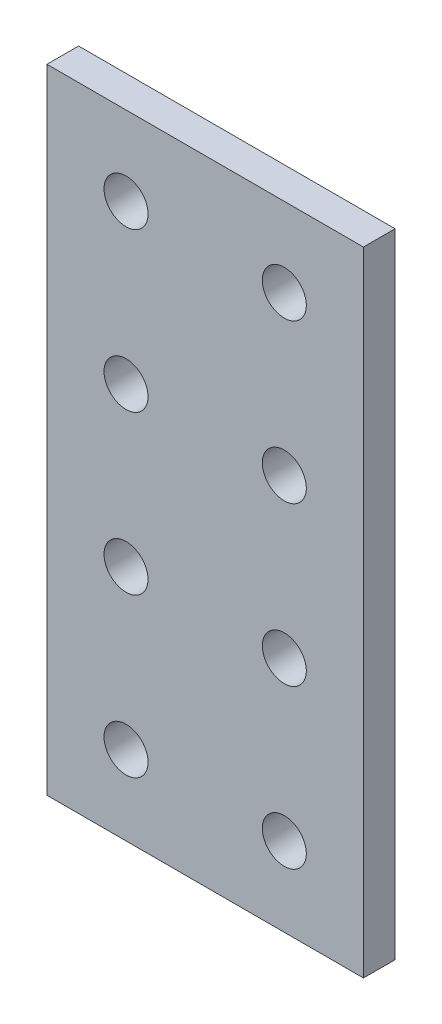
ISO-10303-21;
HEADER;
FILE_DESCRIPTION(('STEP AP214'),'2;1');
FILE_NAME('part.step','',(''),(''),'','','');
FILE_SCHEMA(('AUTOMOTIVE_DESIGN { 1 0 10303 214 1 1 1 1 }'));
ENDSEC;
DATA;
#1=APPLICATION_CONTEXT('core data for automotive mechanical design processes');
#2=APPLICATION_PROTOCOL_DEFINITION('international standard','automotive_design',2000,#1);
#3=PRODUCT_CONTEXT('',#1,'mechanical');
#4=PRODUCT('Part','Part','',(#3));
#5=PRODUCT_RELATED_PRODUCT_CATEGORY('part','',(#4));
#6=PRODUCT_DEFINITION_FORMATION('','',#4);
#7=PRODUCT_DEFINITION_CONTEXT('part definition',#1,'design');
#8=PRODUCT_DEFINITION('design','',#6,#7);
#9=PRODUCT_DEFINITION_SHAPE('','',#8);
#10=(LENGTH_UNIT() NAMED_UNIT(*) SI_UNIT(.MILLI.,.METRE.));
#11=(NAMED_UNIT(*) PLANE_ANGLE_UNIT() SI_UNIT($,.RADIAN.));
#12=(NAMED_UNIT(*) SI_UNIT($,.STERADIAN.) SOLID_ANGLE_UNIT());
#13=UNCERTAINTY_MEASURE_WITH_UNIT(LENGTH_MEASURE(1.E-05),#10,'distance_accuracy_value','');
#14=(GEOMETRIC_REPRESENTATION_CONTEXT(3) GLOBAL_UNCERTAINTY_ASSIGNED_CONTEXT((#13)) GLOBAL_UNIT_ASSIGNED_CONTEXT((#10,
#11,#12)) REPRESENTATION_CONTEXT('',''));
#15=CARTESIAN_POINT('',(0.,0.,0.));
#16=DIRECTION('',(0.,0.,1.));
#17=DIRECTION('',(1.,0.,0.));
#18=AXIS2_PLACEMENT_3D('',#15,#16,#17);
#19=CARTESIAN_POINT('',(20.,0.,0.));
#20=DIRECTION('',(1.,0.,0.));
#21=DIRECTION('',(0.,0.,-1.));
#22=AXIS2_PLACEMENT_3D('',#19,#20,#21);
#23=PLANE('',#22);
#24=DIRECTION('',(0.,1.,0.));
#25=VECTOR('',#24,1.);
#26=CARTESIAN_POINT('',(20.,0.,4.));
#27=LINE('',#26,#25);
#28=CARTESIAN_POINT('',(20.,0.,4.));
#29=VERTEX_POINT('',#28);
#30=CARTESIAN_POINT('',(20.,80.,4.));
#31=VERTEX_POINT('',#30);
#32=EDGE_CURVE('E102',#29,#31,#27,.T.);
#33=ORIENTED_EDGE('',*,*,#32,.F.);
#34=DIRECTION('',(0.,0.,1.));
#35=VECTOR('',#34,1.);
#36=CARTESIAN_POINT('',(20.,0.,0.));
#37=LINE('',#36,#35);
#38=CARTESIAN_POINT('',(20.,0.,0.));
#39=VERTEX_POINT('',#38);
#40=EDGE_CURVE('E11',#39,#29,#37,.T.);
#41=ORIENTED_EDGE('',*,*,#40,.F.);
#42=DIRECTION('',(0.,1.,0.));
#43=VECTOR('',#42,1.);
#44=CARTESIAN_POINT('',(20.,0.,0.));
#45=LINE('',#44,#43);
#46=CARTESIAN_POINT('',(20.,80.,0.));
#47=VERTEX_POINT('',#46);
#48=EDGE_CURVE('E95',#39,#47,#45,.T.);
#49=ORIENTED_EDGE('',*,*,#48,.T.);
#50=DIRECTION('',(0.,0.,1.));
#51=VECTOR('',#50,1.);
#52=CARTESIAN_POINT('',(20.,80.,0.));
#53=LINE('',#52,#51);
#54=EDGE_CURVE('E40',#47,#31,#53,.T.);
#55=ORIENTED_EDGE('',*,*,#54,.T.);
#56=EDGE_LOOP('',(#33,#41,#49,#55));
#57=FACE_BOUND('',#56,.T.);
#58=ADVANCED_FACE('F37',(#57),#23,.T.);
#59=CARTESIAN_POINT('',(-20.,0.,0.));
#60=DIRECTION('',(0.,-1.,0.));
#61=DIRECTION('',(0.,0.,-1.));
#62=AXIS2_PLACEMENT_3D('',#59,#60,#61);
#63=PLANE('',#62);
#64=DIRECTION('',(1.,0.,0.));
#65=VECTOR('',#64,1.);
#66=CARTESIAN_POINT('',(-20.,0.,4.));
#67=LINE('',#66,#65);
#68=CARTESIAN_POINT('',(-20.,0.,4.));
#69=VERTEX_POINT('',#68);
#70=EDGE_CURVE('E97',#69,#29,#67,.T.);
#71=ORIENTED_EDGE('',*,*,#70,.F.);
#72=DIRECTION('',(0.,0.,1.));
#73=VECTOR('',#72,1.);
#74=CARTESIAN_POINT('',(-20.,0.,0.));
#75=LINE('',#74,#73);
#76=CARTESIAN_POINT('',(-20.,0.,0.));
#77=VERTEX_POINT('',#76);
#78=EDGE_CURVE('E46',#77,#69,#75,.T.);
#79=ORIENTED_EDGE('',*,*,#78,.F.);
#80=DIRECTION('',(1.,0.,0.));
#81=VECTOR('',#80,1.);
#82=CARTESIAN_POINT('',(-20.,0.,0.));
#83=LINE('',#82,#81);
#84=EDGE_CURVE('E92',#77,#39,#83,.T.);
#85=ORIENTED_EDGE('',*,*,#84,.T.);
#86=ORIENTED_EDGE('',*,*,#40,.T.);
#87=EDGE_LOOP('',(#71,#79,#85,#86));
#88=FACE_BOUND('',#87,.T.);
#89=ADVANCED_FACE('F113',(#88),#63,.T.);
#90=CARTESIAN_POINT('',(-20.,80.,0.));
#91=DIRECTION('',(-1.,0.,0.));
#92=DIRECTION('',(0.,0.,1.));
#93=AXIS2_PLACEMENT_3D('',#90,#91,#92);
#94=PLANE('',#93);
#95=DIRECTION('',(0.,-1.,0.));
#96=VECTOR('',#95,1.);
#97=CARTESIAN_POINT('',(-20.,80.,4.));
#98=LINE('',#97,#96);
#99=CARTESIAN_POINT('',(-20.,80.,4.));
#100=VERTEX_POINT('',#99);
#101=EDGE_CURVE('E87',#100,#69,#98,.T.);
#102=ORIENTED_EDGE('',*,*,#101,.F.);
#103=DIRECTION('',(0.,0.,1.));
#104=VECTOR('',#103,1.);
#105=CARTESIAN_POINT('',(-20.,80.,0.));
#106=LINE('',#105,#104);
#107=CARTESIAN_POINT('',(-20.,80.,0.));
#108=VERTEX_POINT('',#107);
#109=EDGE_CURVE('E82',#108,#100,#106,.T.);
#110=ORIENTED_EDGE('',*,*,#109,.F.);
#111=DIRECTION('',(0.,-1.,0.));
#112=VECTOR('',#111,1.);
#113=CARTESIAN_POINT('',(-20.,80.,0.));
#114=LINE('',#113,#112);
#115=EDGE_CURVE('E85',#108,#77,#114,.T.);
#116=ORIENTED_EDGE('',*,*,#115,.T.);
#117=ORIENTED_EDGE('',*,*,#78,.T.);
#118=EDGE_LOOP('',(#102,#110,#116,#117));
#119=FACE_BOUND('',#118,.T.);
#120=ADVANCED_FACE('F84',(#119),#94,.T.);
#121=CARTESIAN_POINT('',(20.,80.,0.));
#122=DIRECTION('',(0.,1.,0.));
#123=DIRECTION('',(0.,0.,1.));
#124=AXIS2_PLACEMENT_3D('',#121,#122,#123);
#125=PLANE('',#124);
#126=DIRECTION('',(-1.,0.,0.));
#127=VECTOR('',#126,1.);
#128=CARTESIAN_POINT('',(20.,80.,4.));
#129=LINE('',#128,#127);
#130=EDGE_CURVE('E105',#31,#100,#129,.T.);
#131=ORIENTED_EDGE('',*,*,#130,.F.);
#132=ORIENTED_EDGE('',*,*,#54,.F.);
#133=DIRECTION('',(-1.,0.,0.));
#134=VECTOR('',#133,1.);
#135=CARTESIAN_POINT('',(20.,80.,0.));
#136=LINE('',#135,#134);
#137=EDGE_CURVE('E91',#47,#108,#136,.T.);
#138=ORIENTED_EDGE('',*,*,#137,.T.);
#139=ORIENTED_EDGE('',*,*,#109,.T.);
#140=EDGE_LOOP('',(#131,#132,#138,#139));
#141=FACE_BOUND('',#140,.T.);
#142=ADVANCED_FACE('F94',(#141),#125,.T.);
#143=CARTESIAN_POINT('',(0.,0.,0.));
#144=DIRECTION('',(0.,0.,1.));
#145=DIRECTION('',(1.,0.,0.));
#146=AXIS2_PLACEMENT_3D('',#143,#144,#145);
#147=PLANE('',#146);
#148=CARTESIAN_POINT('',(10.,10.,0.));
#149=DIRECTION('',(0.,0.,1.));
#150=DIRECTION('',(-1.,0.,0.));
#151=AXIS2_PLACEMENT_3D('',#148,#149,#150);
#152=CIRCLE('',#151,2.78);
#153=CARTESIAN_POINT('',(7.22,10.,0.));
#154=VERTEX_POINT('',#153);
#155=EDGE_CURVE('E170',#154,#154,#152,.T.);
#156=ORIENTED_EDGE('',*,*,#155,.T.);
#157=EDGE_LOOP('',(#156));
#158=FACE_BOUND('',#157,.T.);
#159=CARTESIAN_POINT('',(10.,30.,0.));
#160=DIRECTION('',(0.,0.,1.));
#161=DIRECTION('',(-1.,0.,0.));
#162=AXIS2_PLACEMENT_3D('',#159,#160,#161);
#163=CIRCLE('',#162,2.78);
#164=CARTESIAN_POINT('',(7.22,30.,0.));
#165=VERTEX_POINT('',#164);
#166=EDGE_CURVE('E178',#165,#165,#163,.T.);
#167=ORIENTED_EDGE('',*,*,#166,.T.);
#168=EDGE_LOOP('',(#167));
#169=FACE_BOUND('',#168,.T.);
#170=CARTESIAN_POINT('',(10.,50.,0.));
#171=DIRECTION('',(0.,0.,1.));
#172=DIRECTION('',(-1.,0.,0.));
#173=AXIS2_PLACEMENT_3D('',#170,#171,#172);
#174=CIRCLE('',#173,2.78);
#175=CARTESIAN_POINT('',(7.22,50.,0.));
#176=VERTEX_POINT('',#175);
#177=EDGE_CURVE('E184',#176,#176,#174,.T.);
#178=ORIENTED_EDGE('',*,*,#177,.T.);
#179=EDGE_LOOP('',(#178));
#180=FACE_BOUND('',#179,.T.);
#181=CARTESIAN_POINT('',(10.,70.,0.));
#182=DIRECTION('',(0.,0.,1.));
#183=DIRECTION('',(-1.,0.,0.));
#184=AXIS2_PLACEMENT_3D('',#181,#182,#183);
#185=CIRCLE('',#184,2.78);
#186=CARTESIAN_POINT('',(7.22,70.,0.));
#187=VERTEX_POINT('',#186);
#188=EDGE_CURVE('E190',#187,#187,#185,.T.);
#189=ORIENTED_EDGE('',*,*,#188,.T.);
#190=EDGE_LOOP('',(#189));
#191=FACE_BOUND('',#190,.T.);
#192=CARTESIAN_POINT('',(-10.,10.,0.));
#193=DIRECTION('',(0.,0.,1.));
#194=DIRECTION('',(-1.,0.,0.));
#195=AXIS2_PLACEMENT_3D('',#192,#193,#194);
#196=CIRCLE('',#195,2.78);
#197=CARTESIAN_POINT('',(-12.78,10.,0.));
#198=VERTEX_POINT('',#197);
#199=EDGE_CURVE('E196',#198,#198,#196,.T.);
#200=ORIENTED_EDGE('',*,*,#199,.T.);
#201=EDGE_LOOP('',(#200));
#202=FACE_BOUND('',#201,.T.);
#203=CARTESIAN_POINT('',(-10.,30.,0.));
#204=DIRECTION('',(0.,0.,1.));
#205=DIRECTION('',(-1.,0.,0.));
#206=AXIS2_PLACEMENT_3D('',#203,#204,#205);
#207=CIRCLE('',#206,2.78);
#208=CARTESIAN_POINT('',(-12.78,30.,0.));
#209=VERTEX_POINT('',#208);
#210=EDGE_CURVE('E202',#209,#209,#207,.T.);
#211=ORIENTED_EDGE('',*,*,#210,.T.);
#212=EDGE_LOOP('',(#211));
#213=FACE_BOUND('',#212,.T.);
#214=CARTESIAN_POINT('',(-10.,50.,0.));
#215=DIRECTION('',(0.,0.,1.));
#216=DIRECTION('',(-1.,0.,0.));
#217=AXIS2_PLACEMENT_3D('',#214,#215,#216);
#218=CIRCLE('',#217,2.78);
#219=CARTESIAN_POINT('',(-12.78,50.,0.));
#220=VERTEX_POINT('',#219);
#221=EDGE_CURVE('E208',#220,#220,#218,.T.);
#222=ORIENTED_EDGE('',*,*,#221,.T.);
#223=EDGE_LOOP('',(#222));
#224=FACE_BOUND('',#223,.T.);
#225=CARTESIAN_POINT('',(-10.,70.,0.));
#226=DIRECTION('',(0.,0.,1.));
#227=DIRECTION('',(-1.,0.,0.));
#228=AXIS2_PLACEMENT_3D('',#225,#226,#227);
#229=CIRCLE('',#228,2.78);
#230=CARTESIAN_POINT('',(-12.78,70.,0.));
#231=VERTEX_POINT('',#230);
#232=EDGE_CURVE('E106',#231,#231,#229,.T.);
#233=ORIENTED_EDGE('',*,*,#232,.T.);
#234=EDGE_LOOP('',(#233));
#235=FACE_BOUND('',#234,.T.);
#236=ORIENTED_EDGE('',*,*,#48,.F.);
#237=ORIENTED_EDGE('',*,*,#84,.F.);
#238=ORIENTED_EDGE('',*,*,#115,.F.);
#239=ORIENTED_EDGE('',*,*,#137,.F.);
#240=EDGE_LOOP('',(#236,#237,#238,#239));
#241=FACE_BOUND('',#240,.T.);
#242=ADVANCED_FACE('F90',(#158,#169,#180,#191,#202,#213,#224,#235,#241),#147,.F.);
#243=CARTESIAN_POINT('',(0.,0.,4.));
#244=DIRECTION('',(0.,0.,1.));
#245=DIRECTION('',(1.,0.,0.));
#246=AXIS2_PLACEMENT_3D('',#243,#244,#245);
#247=PLANE('',#246);
#248=CARTESIAN_POINT('',(10.,10.,4.));
#249=DIRECTION('',(0.,0.,1.));
#250=DIRECTION('',(-1.,0.,0.));
#251=AXIS2_PLACEMENT_3D('',#248,#249,#250);
#252=CIRCLE('',#251,2.78);
#253=CARTESIAN_POINT('',(7.22,10.,4.));
#254=VERTEX_POINT('',#253);
#255=EDGE_CURVE('E173',#254,#254,#252,.T.);
#256=ORIENTED_EDGE('',*,*,#255,.F.);
#257=EDGE_LOOP('',(#256));
#258=FACE_BOUND('',#257,.T.);
#259=CARTESIAN_POINT('',(10.,30.,4.));
#260=DIRECTION('',(0.,0.,1.));
#261=DIRECTION('',(-1.,0.,0.));
#262=AXIS2_PLACEMENT_3D('',#259,#260,#261);
#263=CIRCLE('',#262,2.78);
#264=CARTESIAN_POINT('',(7.22,30.,4.));
#265=VERTEX_POINT('',#264);
#266=EDGE_CURVE('E175',#265,#265,#263,.T.);
#267=ORIENTED_EDGE('',*,*,#266,.F.);
#268=EDGE_LOOP('',(#267));
#269=FACE_BOUND('',#268,.T.);
#270=CARTESIAN_POINT('',(10.,50.,4.));
#271=DIRECTION('',(0.,0.,1.));
#272=DIRECTION('',(-1.,0.,0.));
#273=AXIS2_PLACEMENT_3D('',#270,#271,#272);
#274=CIRCLE('',#273,2.78);
#275=CARTESIAN_POINT('',(7.22,50.,4.));
#276=VERTEX_POINT('',#275);
#277=EDGE_CURVE('E181',#276,#276,#274,.T.);
#278=ORIENTED_EDGE('',*,*,#277,.F.);
#279=EDGE_LOOP('',(#278));
#280=FACE_BOUND('',#279,.T.);
#281=CARTESIAN_POINT('',(10.,70.,4.));
#282=DIRECTION('',(0.,0.,1.));
#283=DIRECTION('',(-1.,0.,0.));
#284=AXIS2_PLACEMENT_3D('',#281,#282,#283);
#285=CIRCLE('',#284,2.78);
#286=CARTESIAN_POINT('',(7.22,70.,4.));
#287=VERTEX_POINT('',#286);
#288=EDGE_CURVE('E187',#287,#287,#285,.T.);
#289=ORIENTED_EDGE('',*,*,#288,.F.);
#290=EDGE_LOOP('',(#289));
#291=FACE_BOUND('',#290,.T.);
#292=CARTESIAN_POINT('',(-10.,10.,4.));
#293=DIRECTION('',(0.,0.,1.));
#294=DIRECTION('',(-1.,0.,0.));
#295=AXIS2_PLACEMENT_3D('',#292,#293,#294);
#296=CIRCLE('',#295,2.78);
#297=CARTESIAN_POINT('',(-12.78,10.,4.));
#298=VERTEX_POINT('',#297);
#299=EDGE_CURVE('E193',#298,#298,#296,.T.);
#300=ORIENTED_EDGE('',*,*,#299,.F.);
#301=EDGE_LOOP('',(#300));
#302=FACE_BOUND('',#301,.T.);
#303=CARTESIAN_POINT('',(-10.,30.,4.));
#304=DIRECTION('',(0.,0.,1.));
#305=DIRECTION('',(-1.,0.,0.));
#306=AXIS2_PLACEMENT_3D('',#303,#304,#305);
#307=CIRCLE('',#306,2.78);
#308=CARTESIAN_POINT('',(-12.78,30.,4.));
#309=VERTEX_POINT('',#308);
#310=EDGE_CURVE('E199',#309,#309,#307,.T.);
#311=ORIENTED_EDGE('',*,*,#310,.F.);
#312=EDGE_LOOP('',(#311));
#313=FACE_BOUND('',#312,.T.);
#314=CARTESIAN_POINT('',(-10.,50.,4.));
#315=DIRECTION('',(0.,0.,1.));
#316=DIRECTION('',(-1.,0.,0.));
#317=AXIS2_PLACEMENT_3D('',#314,#315,#316);
#318=CIRCLE('',#317,2.78);
#319=CARTESIAN_POINT('',(-12.78,50.,4.));
#320=VERTEX_POINT('',#319);
#321=EDGE_CURVE('E205',#320,#320,#318,.T.);
#322=ORIENTED_EDGE('',*,*,#321,.F.);
#323=EDGE_LOOP('',(#322));
#324=FACE_BOUND('',#323,.T.);
#325=CARTESIAN_POINT('',(-10.,70.,4.));
#326=DIRECTION('',(0.,0.,1.));
#327=DIRECTION('',(-1.,0.,0.));
#328=AXIS2_PLACEMENT_3D('',#325,#326,#327);
#329=CIRCLE('',#328,2.78);
#330=CARTESIAN_POINT('',(-12.78,70.,4.));
#331=VERTEX_POINT('',#330);
#332=EDGE_CURVE('E211',#331,#331,#329,.T.);
#333=ORIENTED_EDGE('',*,*,#332,.F.);
#334=EDGE_LOOP('',(#333));
#335=FACE_BOUND('',#334,.T.);
#336=ORIENTED_EDGE('',*,*,#32,.T.);
#337=ORIENTED_EDGE('',*,*,#130,.T.);
#338=ORIENTED_EDGE('',*,*,#101,.T.);
#339=ORIENTED_EDGE('',*,*,#70,.T.);
#340=EDGE_LOOP('',(#336,#337,#338,#339));
#341=FACE_BOUND('',#340,.T.);
#342=ADVANCED_FACE('F112',(#258,#269,#280,#291,#302,#313,#324,#335,#341),#247,.T.);
#343=CARTESIAN_POINT('',(-10.,70.,0.));
#344=DIRECTION('',(0.,0.,1.));
#345=DIRECTION('',(1.,0.,0.));
#346=AXIS2_PLACEMENT_3D('',#343,#344,#345);
#347=CYLINDRICAL_SURFACE('',#346,2.78);
#348=ORIENTED_EDGE('',*,*,#232,.F.);
#349=EDGE_LOOP('',(#348));
#350=FACE_BOUND('',#349,.T.);
#351=ORIENTED_EDGE('',*,*,#332,.T.);
#352=EDGE_LOOP('',(#351));
#353=FACE_BOUND('',#352,.T.);
#354=ADVANCED_FACE('F131',(#350,#353),#347,.F.);
#355=CARTESIAN_POINT('',(-10.,50.,0.));
#356=DIRECTION('',(0.,0.,1.));
#357=DIRECTION('',(1.,0.,0.));
#358=AXIS2_PLACEMENT_3D('',#355,#356,#357);
#359=CYLINDRICAL_SURFACE('',#358,2.78);
#360=ORIENTED_EDGE('',*,*,#221,.F.);
#361=EDGE_LOOP('',(#360));
#362=FACE_BOUND('',#361,.T.);
#363=ORIENTED_EDGE('',*,*,#321,.T.);
#364=EDGE_LOOP('',(#363));
#365=FACE_BOUND('',#364,.T.);
#366=ADVANCED_FACE('F138',(#362,#365),#359,.F.);
#367=CARTESIAN_POINT('',(-10.,30.,0.));
#368=DIRECTION('',(0.,0.,1.));
#369=DIRECTION('',(1.,0.,0.));
#370=AXIS2_PLACEMENT_3D('',#367,#368,#369);
#371=CYLINDRICAL_SURFACE('',#370,2.78);
#372=ORIENTED_EDGE('',*,*,#210,.F.);
#373=EDGE_LOOP('',(#372));
#374=FACE_BOUND('',#373,.T.);
#375=ORIENTED_EDGE('',*,*,#310,.T.);
#376=EDGE_LOOP('',(#375));
#377=FACE_BOUND('',#376,.T.);
#378=ADVANCED_FACE('F142',(#374,#377),#371,.F.);
#379=CARTESIAN_POINT('',(-10.,10.,0.));
#380=DIRECTION('',(0.,0.,1.));
#381=DIRECTION('',(1.,0.,0.));
#382=AXIS2_PLACEMENT_3D('',#379,#380,#381);
#383=CYLINDRICAL_SURFACE('',#382,2.78);
#384=ORIENTED_EDGE('',*,*,#199,.F.);
#385=EDGE_LOOP('',(#384));
#386=FACE_BOUND('',#385,.T.);
#387=ORIENTED_EDGE('',*,*,#299,.T.);
#388=EDGE_LOOP('',(#387));
#389=FACE_BOUND('',#388,.T.);
#390=ADVANCED_FACE('F146',(#386,#389),#383,.F.);
#391=CARTESIAN_POINT('',(10.,70.,0.));
#392=DIRECTION('',(0.,0.,1.));
#393=DIRECTION('',(1.,0.,0.));
#394=AXIS2_PLACEMENT_3D('',#391,#392,#393);
#395=CYLINDRICAL_SURFACE('',#394,2.78);
#396=ORIENTED_EDGE('',*,*,#188,.F.);
#397=EDGE_LOOP('',(#396));
#398=FACE_BOUND('',#397,.T.);
#399=ORIENTED_EDGE('',*,*,#288,.T.);
#400=EDGE_LOOP('',(#399));
#401=FACE_BOUND('',#400,.T.);
#402=ADVANCED_FACE('F150',(#398,#401),#395,.F.);
#403=CARTESIAN_POINT('',(10.,50.,0.));
#404=DIRECTION('',(0.,0.,1.));
#405=DIRECTION('',(1.,0.,0.));
#406=AXIS2_PLACEMENT_3D('',#403,#404,#405);
#407=CYLINDRICAL_SURFACE('',#406,2.78);
#408=ORIENTED_EDGE('',*,*,#177,.F.);
#409=EDGE_LOOP('',(#408));
#410=FACE_BOUND('',#409,.T.);
#411=ORIENTED_EDGE('',*,*,#277,.T.);
#412=EDGE_LOOP('',(#411));
#413=FACE_BOUND('',#412,.T.);
#414=ADVANCED_FACE('F154',(#410,#413),#407,.F.);
#415=CARTESIAN_POINT('',(10.,30.,0.));
#416=DIRECTION('',(0.,0.,1.));
#417=DIRECTION('',(1.,0.,0.));
#418=AXIS2_PLACEMENT_3D('',#415,#416,#417);
#419=CYLINDRICAL_SURFACE('',#418,2.78);
#420=ORIENTED_EDGE('',*,*,#166,.F.);
#421=EDGE_LOOP('',(#420));
#422=FACE_BOUND('',#421,.T.);
#423=ORIENTED_EDGE('',*,*,#266,.T.);
#424=EDGE_LOOP('',(#423));
#425=FACE_BOUND('',#424,.T.);
#426=ADVANCED_FACE('F158',(#422,#425),#419,.F.);
#427=CARTESIAN_POINT('',(10.,10.,0.));
#428=DIRECTION('',(0.,0.,1.));
#429=DIRECTION('',(1.,0.,0.));
#430=AXIS2_PLACEMENT_3D('',#427,#428,#429);
#431=CYLINDRICAL_SURFACE('',#430,2.78);
#432=ORIENTED_EDGE('',*,*,#155,.F.);
#433=EDGE_LOOP('',(#432));
#434=FACE_BOUND('',#433,.T.);
#435=ORIENTED_EDGE('',*,*,#255,.T.);
#436=EDGE_LOOP('',(#435));
#437=FACE_BOUND('',#436,.T.);
#438=ADVANCED_FACE('F162',(#434,#437),#431,.F.);
#439=CLOSED_SHELL('',(#58,#89,#120,#142,#242,#342,#354,#366,#378,#390,#402,#414,#426,#438));
#440=MANIFOLD_SOLID_BREP('B2',#439);
#441=ADVANCED_BREP_SHAPE_REPRESENTATION('',(#18,#440),#14);
#442=SHAPE_DEFINITION_REPRESENTATION(#9,#441);
ENDSEC;
END-ISO-10303-21;
